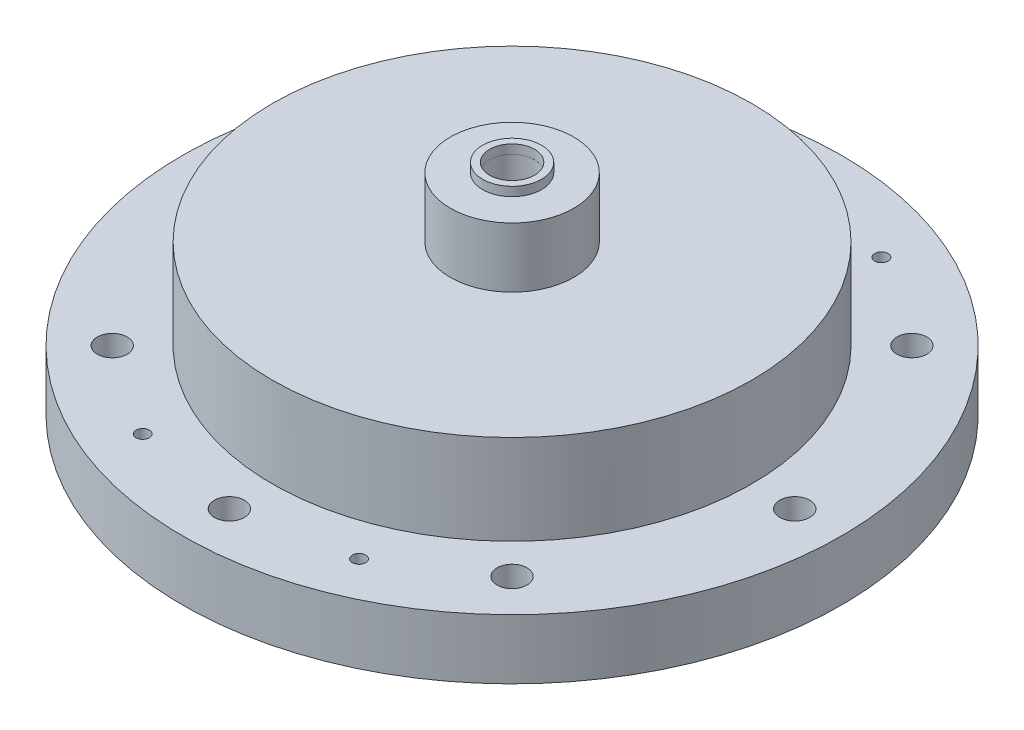
ISO-10303-21;
HEADER;
FILE_DESCRIPTION(('STEP AP214'),'2;1');
FILE_NAME('part.step','',(''),(''),'','','');
FILE_SCHEMA(('AUTOMOTIVE_DESIGN { 1 0 10303 214 1 1 1 1 }'));
ENDSEC;
DATA;
#1=APPLICATION_CONTEXT('core data for automotive mechanical design processes');
#2=APPLICATION_PROTOCOL_DEFINITION('international standard','automotive_design',2000,#1);
#3=PRODUCT_CONTEXT('',#1,'mechanical');
#4=PRODUCT('Part','Part','',(#3));
#5=PRODUCT_RELATED_PRODUCT_CATEGORY('part','',(#4));
#6=PRODUCT_DEFINITION_FORMATION('','',#4);
#7=PRODUCT_DEFINITION_CONTEXT('part definition',#1,'design');
#8=PRODUCT_DEFINITION('design','',#6,#7);
#9=PRODUCT_DEFINITION_SHAPE('','',#8);
#10=(LENGTH_UNIT() NAMED_UNIT(*) SI_UNIT(.MILLI.,.METRE.));
#11=(NAMED_UNIT(*) PLANE_ANGLE_UNIT() SI_UNIT($,.RADIAN.));
#12=(NAMED_UNIT(*) SI_UNIT($,.STERADIAN.) SOLID_ANGLE_UNIT());
#13=UNCERTAINTY_MEASURE_WITH_UNIT(LENGTH_MEASURE(1.E-05),#10,'distance_accuracy_value','');
#14=(GEOMETRIC_REPRESENTATION_CONTEXT(3) GLOBAL_UNCERTAINTY_ASSIGNED_CONTEXT((#13)) GLOBAL_UNIT_ASSIGNED_CONTEXT((#10,
#11,#12)) REPRESENTATION_CONTEXT('',''));
#15=CARTESIAN_POINT('',(0.,0.,0.));
#16=DIRECTION('',(0.,0.,1.));
#17=DIRECTION('',(1.,0.,0.));
#18=AXIS2_PLACEMENT_3D('',#15,#16,#17);
#19=CARTESIAN_POINT('',(0.,46.355,0.));
#20=DIRECTION('',(0.,-1.,0.));
#21=DIRECTION('',(0.,0.,-1.));
#22=AXIS2_PLACEMENT_3D('',#19,#20,#21);
#23=CYLINDRICAL_SURFACE('',#22,6.2484);
#24=CARTESIAN_POINT('',(0.,46.355,0.));
#25=DIRECTION('',(0.,1.,0.));
#26=DIRECTION('',(0.,0.,1.));
#27=AXIS2_PLACEMENT_3D('',#24,#25,#26);
#28=CIRCLE('',#27,6.2484);
#29=CARTESIAN_POINT('',(0.,46.355,6.2484));
#30=VERTEX_POINT('',#29);
#31=EDGE_CURVE('E11',#30,#30,#28,.T.);
#32=ORIENTED_EDGE('',*,*,#31,.F.);
#33=EDGE_LOOP('',(#32));
#34=FACE_BOUND('',#33,.T.);
#35=CARTESIAN_POINT('',(0.,44.45,0.));
#36=DIRECTION('',(0.,1.,0.));
#37=DIRECTION('',(0.,0.,1.));
#38=AXIS2_PLACEMENT_3D('',#35,#36,#37);
#39=CIRCLE('',#38,6.2484);
#40=CARTESIAN_POINT('',(0.,44.45,6.2484));
#41=VERTEX_POINT('',#40);
#42=EDGE_CURVE('E50',#41,#41,#39,.T.);
#43=ORIENTED_EDGE('',*,*,#42,.T.);
#44=EDGE_LOOP('',(#43));
#45=FACE_BOUND('',#44,.T.);
#46=ADVANCED_FACE('F43',(#34,#45),#23,.T.);
#47=CARTESIAN_POINT('',(0.,46.355,0.));
#48=DIRECTION('',(0.,1.,0.));
#49=DIRECTION('',(0.,0.,1.));
#50=AXIS2_PLACEMENT_3D('',#47,#48,#49);
#51=PLANE('',#50);
#52=CARTESIAN_POINT('',(0.,46.355,0.));
#53=DIRECTION('',(0.,1.,0.));
#54=DIRECTION('',(0.,0.,1.));
#55=AXIS2_PLACEMENT_3D('',#52,#53,#54);
#56=CIRCLE('',#55,4.7625);
#57=CARTESIAN_POINT('',(0.,46.355,4.7625));
#58=VERTEX_POINT('',#57);
#59=EDGE_CURVE('E56',#58,#58,#56,.T.);
#60=ORIENTED_EDGE('',*,*,#59,.F.);
#61=EDGE_LOOP('',(#60));
#62=FACE_BOUND('',#61,.T.);
#63=ORIENTED_EDGE('',*,*,#31,.T.);
#64=EDGE_LOOP('',(#63));
#65=FACE_BOUND('',#64,.T.);
#66=ADVANCED_FACE('F72',(#62,#65),#51,.T.);
#67=CARTESIAN_POINT('',(0.,44.45,0.));
#68=DIRECTION('',(0.,1.,0.));
#69=DIRECTION('',(0.,0.,1.));
#70=AXIS2_PLACEMENT_3D('',#67,#68,#69);
#71=PLANE('',#70);
#72=CARTESIAN_POINT('',(0.,44.45,0.));
#73=DIRECTION('',(0.,1.,0.));
#74=DIRECTION('',(0.,0.,1.));
#75=AXIS2_PLACEMENT_3D('',#72,#73,#74);
#76=CIRCLE('',#75,4.7625);
#77=CARTESIAN_POINT('',(0.,44.45,4.7625));
#78=VERTEX_POINT('',#77);
#79=EDGE_CURVE('E46',#78,#78,#76,.T.);
#80=ORIENTED_EDGE('',*,*,#79,.T.);
#81=EDGE_LOOP('',(#80));
#82=FACE_BOUND('',#81,.T.);
#83=ORIENTED_EDGE('',*,*,#42,.F.);
#84=EDGE_LOOP('',(#83));
#85=FACE_BOUND('',#84,.T.);
#86=ADVANCED_FACE('F63',(#82,#85),#71,.F.);
#87=CARTESIAN_POINT('',(0.,-4.445,0.));
#88=DIRECTION('',(0.,1.,0.));
#89=DIRECTION('',(0.,0.,1.));
#90=AXIS2_PLACEMENT_3D('',#87,#88,#89);
#91=CYLINDRICAL_SURFACE('',#90,4.7625);
#92=ORIENTED_EDGE('',*,*,#59,.T.);
#93=EDGE_LOOP('',(#92));
#94=FACE_BOUND('',#93,.T.);
#95=ORIENTED_EDGE('',*,*,#79,.F.);
#96=EDGE_LOOP('',(#95));
#97=FACE_BOUND('',#96,.T.);
#98=ADVANCED_FACE('F66',(#94,#97),#91,.F.);
#99=CLOSED_SHELL('',(#46,#66,#86,#98));
#100=MANIFOLD_SOLID_BREP('B2',#99);
#101=CARTESIAN_POINT('',(0.,25.4,0.));
#102=DIRECTION('',(0.,-1.,0.));
#103=DIRECTION('',(0.,0.,-1.));
#104=AXIS2_PLACEMENT_3D('',#101,#102,#103);
#105=CYLINDRICAL_SURFACE('',#104,50.8);
#106=CARTESIAN_POINT('',(0.,12.7,0.));
#107=DIRECTION('',(0.,-1.,0.));
#108=DIRECTION('',(0.,0.,-1.));
#109=AXIS2_PLACEMENT_3D('',#106,#107,#108);
#110=CIRCLE('',#109,50.8);
#111=CARTESIAN_POINT('',(0.,12.7,-50.8));
#112=VERTEX_POINT('',#111);
#113=EDGE_CURVE('E42',#112,#112,#110,.T.);
#114=ORIENTED_EDGE('',*,*,#113,.F.);
#115=EDGE_LOOP('',(#114));
#116=FACE_BOUND('',#115,.T.);
#117=CARTESIAN_POINT('',(0.,31.75,0.));
#118=DIRECTION('',(0.,1.,0.));
#119=DIRECTION('',(0.,0.,1.));
#120=AXIS2_PLACEMENT_3D('',#117,#118,#119);
#121=CIRCLE('',#120,50.8);
#122=CARTESIAN_POINT('',(0.,31.75,50.8));
#123=VERTEX_POINT('',#122);
#124=EDGE_CURVE('E160',#123,#123,#121,.T.);
#125=ORIENTED_EDGE('',*,*,#124,.F.);
#126=EDGE_LOOP('',(#125));
#127=FACE_BOUND('',#126,.T.);
#128=ADVANCED_FACE('F105',(#116,#127),#105,.T.);
#129=CARTESIAN_POINT('',(0.,12.7,0.));
#130=DIRECTION('',(0.,-1.,0.));
#131=DIRECTION('',(0.,0.,-1.));
#132=AXIS2_PLACEMENT_3D('',#129,#130,#131);
#133=CYLINDRICAL_SURFACE('',#132,69.85);
#134=CARTESIAN_POINT('',(0.,12.7,0.));
#135=DIRECTION('',(0.,-1.,0.));
#136=DIRECTION('',(0.,0.,-1.));
#137=AXIS2_PLACEMENT_3D('',#134,#135,#136);
#138=CIRCLE('',#137,69.85);
#139=CARTESIAN_POINT('',(0.,12.7,-69.85));
#140=VERTEX_POINT('',#139);
#141=EDGE_CURVE('E112',#140,#140,#138,.T.);
#142=ORIENTED_EDGE('',*,*,#141,.T.);
#143=EDGE_LOOP('',(#142));
#144=FACE_BOUND('',#143,.T.);
#145=CARTESIAN_POINT('',(0.,0.,0.));
#146=DIRECTION('',(0.,-1.,0.));
#147=DIRECTION('',(0.,0.,-1.));
#148=AXIS2_PLACEMENT_3D('',#145,#146,#147);
#149=CIRCLE('',#148,69.85);
#150=CARTESIAN_POINT('',(0.,0.,-69.85));
#151=VERTEX_POINT('',#150);
#152=EDGE_CURVE('E117',#151,#151,#149,.T.);
#153=ORIENTED_EDGE('',*,*,#152,.F.);
#154=EDGE_LOOP('',(#153));
#155=FACE_BOUND('',#154,.T.);
#156=ADVANCED_FACE('F228',(#144,#155),#133,.T.);
#157=CARTESIAN_POINT('',(0.,12.7,0.));
#158=DIRECTION('',(0.,-1.,0.));
#159=DIRECTION('',(0.,0.,-1.));
#160=AXIS2_PLACEMENT_3D('',#157,#158,#159);
#161=PLANE('',#160);
#162=CARTESIAN_POINT('',(22.9298555105109,12.7,55.3575681567308));
#163=DIRECTION('',(0.,-1.,0.));
#164=DIRECTION('',(0.,0.,-1.));
#165=AXIS2_PLACEMENT_3D('',#162,#163,#164);
#166=CIRCLE('',#165,1.4097);
#167=CARTESIAN_POINT('',(22.9298555105109,12.7,53.9478681567308));
#168=VERTEX_POINT('',#167);
#169=EDGE_CURVE('E108',#168,#168,#166,.T.);
#170=ORIENTED_EDGE('',*,*,#169,.T.);
#171=EDGE_LOOP('',(#170));
#172=FACE_BOUND('',#171,.T.);
#173=CARTESIAN_POINT('',(-22.9298555105109,12.7,-55.3575681567308));
#174=DIRECTION('',(0.,-1.,0.));
#175=DIRECTION('',(0.,0.,-1.));
#176=AXIS2_PLACEMENT_3D('',#173,#174,#175);
#177=CIRCLE('',#176,1.4097);
#178=CARTESIAN_POINT('',(-22.9298555105109,12.7,-56.7672681567308));
#179=VERTEX_POINT('',#178);
#180=EDGE_CURVE('E127',#179,#179,#177,.T.);
#181=ORIENTED_EDGE('',*,*,#180,.T.);
#182=EDGE_LOOP('',(#181));
#183=FACE_BOUND('',#182,.T.);
#184=CARTESIAN_POINT('',(22.9298555105109,12.7,-55.3575681567308));
#185=DIRECTION('',(0.,-1.,0.));
#186=DIRECTION('',(0.,0.,-1.));
#187=AXIS2_PLACEMENT_3D('',#184,#185,#186);
#188=CIRCLE('',#187,1.4097);
#189=CARTESIAN_POINT('',(22.9298555105109,12.7,-56.7672681567308));
#190=VERTEX_POINT('',#189);
#191=EDGE_CURVE('E124',#190,#190,#188,.T.);
#192=ORIENTED_EDGE('',*,*,#191,.T.);
#193=EDGE_LOOP('',(#192));
#194=FACE_BOUND('',#193,.T.);
#195=CARTESIAN_POINT('',(-22.9298555105109,12.7,55.3575681567308));
#196=DIRECTION('',(0.,-1.,0.));
#197=DIRECTION('',(0.,0.,-1.));
#198=AXIS2_PLACEMENT_3D('',#195,#196,#197);
#199=CIRCLE('',#198,1.4097);
#200=CARTESIAN_POINT('',(-22.9298555105109,12.7,53.9478681567308));
#201=VERTEX_POINT('',#200);
#202=EDGE_CURVE('E121',#201,#201,#199,.T.);
#203=ORIENTED_EDGE('',*,*,#202,.T.);
#204=EDGE_LOOP('',(#203));
#205=FACE_BOUND('',#204,.T.);
#206=CARTESIAN_POINT('',(0.,12.7,-59.9186));
#207=DIRECTION('',(0.,-1.,0.));
#208=DIRECTION('',(0.,0.,-1.));
#209=AXIS2_PLACEMENT_3D('',#206,#207,#208);
#210=CIRCLE('',#209,3.175);
#211=CARTESIAN_POINT('',(0.,12.7,-63.0936));
#212=VERTEX_POINT('',#211);
#213=EDGE_CURVE('E178',#212,#212,#210,.F.);
#214=ORIENTED_EDGE('',*,*,#213,.F.);
#215=EDGE_LOOP('',(#214));
#216=FACE_BOUND('',#215,.T.);
#217=CARTESIAN_POINT('',(-42.3688483792043,12.7,-42.3688483792043));
#218=DIRECTION('',(0.,-1.,0.));
#219=DIRECTION('',(0.,0.,-1.));
#220=AXIS2_PLACEMENT_3D('',#217,#218,#219);
#221=CIRCLE('',#220,3.17500000000001);
#222=CARTESIAN_POINT('',(-42.3688483792043,12.7,-45.5438483792043));
#223=VERTEX_POINT('',#222);
#224=EDGE_CURVE('E179',#223,#223,#221,.F.);
#225=ORIENTED_EDGE('',*,*,#224,.F.);
#226=EDGE_LOOP('',(#225));
#227=FACE_BOUND('',#226,.T.);
#228=CARTESIAN_POINT('',(-59.9186,12.7,0.));
#229=DIRECTION('',(0.,-1.,0.));
#230=DIRECTION('',(0.,0.,-1.));
#231=AXIS2_PLACEMENT_3D('',#228,#229,#230);
#232=CIRCLE('',#231,3.17499999999999);
#233=CARTESIAN_POINT('',(-59.9186,12.7,-3.17499999999999));
#234=VERTEX_POINT('',#233);
#235=EDGE_CURVE('E185',#234,#234,#232,.F.);
#236=ORIENTED_EDGE('',*,*,#235,.F.);
#237=EDGE_LOOP('',(#236));
#238=FACE_BOUND('',#237,.T.);
#239=CARTESIAN_POINT('',(-42.3688483792043,12.7,42.3688483792043));
#240=DIRECTION('',(0.,-1.,0.));
#241=DIRECTION('',(0.,0.,-1.));
#242=AXIS2_PLACEMENT_3D('',#239,#240,#241);
#243=CIRCLE('',#242,3.17499999999999);
#244=CARTESIAN_POINT('',(-42.3688483792043,12.7,39.1938483792043));
#245=VERTEX_POINT('',#244);
#246=EDGE_CURVE('E191',#245,#245,#243,.F.);
#247=ORIENTED_EDGE('',*,*,#246,.F.);
#248=EDGE_LOOP('',(#247));
#249=FACE_BOUND('',#248,.T.);
#250=CARTESIAN_POINT('',(0.,12.7,59.9186));
#251=DIRECTION('',(0.,-1.,0.));
#252=DIRECTION('',(0.,0.,-1.));
#253=AXIS2_PLACEMENT_3D('',#250,#251,#252);
#254=CIRCLE('',#253,3.17499999999999);
#255=CARTESIAN_POINT('',(0.,12.7,56.7436));
#256=VERTEX_POINT('',#255);
#257=EDGE_CURVE('E197',#256,#256,#254,.F.);
#258=ORIENTED_EDGE('',*,*,#257,.F.);
#259=EDGE_LOOP('',(#258));
#260=FACE_BOUND('',#259,.T.);
#261=CARTESIAN_POINT('',(42.3688483792043,12.7,42.3688483792043));
#262=DIRECTION('',(0.,-1.,0.));
#263=DIRECTION('',(0.,0.,-1.));
#264=AXIS2_PLACEMENT_3D('',#261,#262,#263);
#265=CIRCLE('',#264,3.17500000000001);
#266=CARTESIAN_POINT('',(42.3688483792043,12.7,39.1938483792043));
#267=VERTEX_POINT('',#266);
#268=EDGE_CURVE('E203',#267,#267,#265,.F.);
#269=ORIENTED_EDGE('',*,*,#268,.F.);
#270=EDGE_LOOP('',(#269));
#271=FACE_BOUND('',#270,.T.);
#272=CARTESIAN_POINT('',(59.9186,12.7,0.));
#273=DIRECTION('',(0.,-1.,0.));
#274=DIRECTION('',(0.,0.,-1.));
#275=AXIS2_PLACEMENT_3D('',#272,#273,#274);
#276=CIRCLE('',#275,3.175);
#277=CARTESIAN_POINT('',(59.9186,12.7,-3.17499999999999));
#278=VERTEX_POINT('',#277);
#279=EDGE_CURVE('E209',#278,#278,#276,.F.);
#280=ORIENTED_EDGE('',*,*,#279,.F.);
#281=EDGE_LOOP('',(#280));
#282=FACE_BOUND('',#281,.T.);
#283=CARTESIAN_POINT('',(42.3688483792043,12.7,-42.3688483792043));
#284=DIRECTION('',(0.,-1.,0.));
#285=DIRECTION('',(0.,0.,-1.));
#286=AXIS2_PLACEMENT_3D('',#283,#284,#285);
#287=CIRCLE('',#286,3.175);
#288=CARTESIAN_POINT('',(42.3688483792043,12.7,-45.5438483792042));
#289=VERTEX_POINT('',#288);
#290=EDGE_CURVE('E215',#289,#289,#287,.F.);
#291=ORIENTED_EDGE('',*,*,#290,.F.);
#292=EDGE_LOOP('',(#291));
#293=FACE_BOUND('',#292,.T.);
#294=ORIENTED_EDGE('',*,*,#113,.T.);
#295=EDGE_LOOP('',(#294));
#296=FACE_BOUND('',#295,.T.);
#297=ORIENTED_EDGE('',*,*,#141,.F.);
#298=EDGE_LOOP('',(#297));
#299=FACE_BOUND('',#298,.T.);
#300=ADVANCED_FACE('F225',(#172,#183,#194,#205,#216,#227,#238,#249,#260,#271,#282,#293,#296,
#299),#161,.F.);
#301=CARTESIAN_POINT('',(0.,0.,0.));
#302=DIRECTION('',(0.,1.,0.));
#303=DIRECTION('',(0.,0.,1.));
#304=AXIS2_PLACEMENT_3D('',#301,#302,#303);
#305=PLANE('',#304);
#306=CARTESIAN_POINT('',(22.9298555105109,0.,55.3575681567308));
#307=DIRECTION('',(0.,-1.,0.));
#308=DIRECTION('',(0.,0.,-1.));
#309=AXIS2_PLACEMENT_3D('',#306,#307,#308);
#310=CIRCLE('',#309,3.175);
#311=CARTESIAN_POINT('',(22.9298555105109,0.,52.1825681567308));
#312=VERTEX_POINT('',#311);
#313=EDGE_CURVE('E149',#312,#312,#310,.T.);
#314=ORIENTED_EDGE('',*,*,#313,.F.);
#315=EDGE_LOOP('',(#314));
#316=FACE_BOUND('',#315,.T.);
#317=CARTESIAN_POINT('',(-22.9298555105109,0.,-55.3575681567308));
#318=DIRECTION('',(0.,-1.,0.));
#319=DIRECTION('',(0.,0.,-1.));
#320=AXIS2_PLACEMENT_3D('',#317,#318,#319);
#321=CIRCLE('',#320,3.175);
#322=CARTESIAN_POINT('',(-22.9298555105109,0.,-58.5325681567308));
#323=VERTEX_POINT('',#322);
#324=EDGE_CURVE('E141',#323,#323,#321,.T.);
#325=ORIENTED_EDGE('',*,*,#324,.F.);
#326=EDGE_LOOP('',(#325));
#327=FACE_BOUND('',#326,.T.);
#328=CARTESIAN_POINT('',(22.9298555105109,0.,-55.3575681567308));
#329=DIRECTION('',(0.,-1.,0.));
#330=DIRECTION('',(0.,0.,-1.));
#331=AXIS2_PLACEMENT_3D('',#328,#329,#330);
#332=CIRCLE('',#331,3.175);
#333=CARTESIAN_POINT('',(22.9298555105109,0.,-58.5325681567308));
#334=VERTEX_POINT('',#333);
#335=EDGE_CURVE('E132',#334,#334,#332,.T.);
#336=ORIENTED_EDGE('',*,*,#335,.F.);
#337=EDGE_LOOP('',(#336));
#338=FACE_BOUND('',#337,.T.);
#339=CARTESIAN_POINT('',(-22.9298555105109,0.,55.3575681567308));
#340=DIRECTION('',(0.,-1.,0.));
#341=DIRECTION('',(0.,0.,-1.));
#342=AXIS2_PLACEMENT_3D('',#339,#340,#341);
#343=CIRCLE('',#342,3.175);
#344=CARTESIAN_POINT('',(-22.9298555105109,0.,52.1825681567308));
#345=VERTEX_POINT('',#344);
#346=EDGE_CURVE('E148',#345,#345,#343,.T.);
#347=ORIENTED_EDGE('',*,*,#346,.F.);
#348=EDGE_LOOP('',(#347));
#349=FACE_BOUND('',#348,.T.);
#350=CARTESIAN_POINT('',(0.,0.,-59.9186));
#351=DIRECTION('',(0.,-1.,0.));
#352=DIRECTION('',(0.,0.,-1.));
#353=AXIS2_PLACEMENT_3D('',#350,#351,#352);
#354=CIRCLE('',#353,3.175);
#355=CARTESIAN_POINT('',(0.,0.,-63.0936));
#356=VERTEX_POINT('',#355);
#357=EDGE_CURVE('E175',#356,#356,#354,.T.);
#358=ORIENTED_EDGE('',*,*,#357,.F.);
#359=EDGE_LOOP('',(#358));
#360=FACE_BOUND('',#359,.T.);
#361=CARTESIAN_POINT('',(-42.3688483792043,0.,-42.3688483792043));
#362=DIRECTION('',(0.,-1.,0.));
#363=DIRECTION('',(0.,0.,-1.));
#364=AXIS2_PLACEMENT_3D('',#361,#362,#363);
#365=CIRCLE('',#364,3.17500000000001);
#366=CARTESIAN_POINT('',(-42.3688483792043,0.,-45.5438483792043));
#367=VERTEX_POINT('',#366);
#368=EDGE_CURVE('E182',#367,#367,#365,.T.);
#369=ORIENTED_EDGE('',*,*,#368,.F.);
#370=EDGE_LOOP('',(#369));
#371=FACE_BOUND('',#370,.T.);
#372=CARTESIAN_POINT('',(-59.9186,0.,0.));
#373=DIRECTION('',(0.,-1.,0.));
#374=DIRECTION('',(0.,0.,-1.));
#375=AXIS2_PLACEMENT_3D('',#372,#373,#374);
#376=CIRCLE('',#375,3.17499999999999);
#377=CARTESIAN_POINT('',(-59.9186,0.,-3.17499999999999));
#378=VERTEX_POINT('',#377);
#379=EDGE_CURVE('E188',#378,#378,#376,.T.);
#380=ORIENTED_EDGE('',*,*,#379,.F.);
#381=EDGE_LOOP('',(#380));
#382=FACE_BOUND('',#381,.T.);
#383=CARTESIAN_POINT('',(-42.3688483792043,0.,42.3688483792043));
#384=DIRECTION('',(0.,-1.,0.));
#385=DIRECTION('',(0.,0.,-1.));
#386=AXIS2_PLACEMENT_3D('',#383,#384,#385);
#387=CIRCLE('',#386,3.17499999999999);
#388=CARTESIAN_POINT('',(-42.3688483792043,0.,39.1938483792043));
#389=VERTEX_POINT('',#388);
#390=EDGE_CURVE('E194',#389,#389,#387,.T.);
#391=ORIENTED_EDGE('',*,*,#390,.F.);
#392=EDGE_LOOP('',(#391));
#393=FACE_BOUND('',#392,.T.);
#394=CARTESIAN_POINT('',(0.,0.,59.9186));
#395=DIRECTION('',(0.,-1.,0.));
#396=DIRECTION('',(0.,0.,-1.));
#397=AXIS2_PLACEMENT_3D('',#394,#395,#396);
#398=CIRCLE('',#397,3.17499999999999);
#399=CARTESIAN_POINT('',(0.,0.,56.7436));
#400=VERTEX_POINT('',#399);
#401=EDGE_CURVE('E200',#400,#400,#398,.T.);
#402=ORIENTED_EDGE('',*,*,#401,.F.);
#403=EDGE_LOOP('',(#402));
#404=FACE_BOUND('',#403,.T.);
#405=CARTESIAN_POINT('',(42.3688483792043,0.,42.3688483792043));
#406=DIRECTION('',(0.,-1.,0.));
#407=DIRECTION('',(0.,0.,-1.));
#408=AXIS2_PLACEMENT_3D('',#405,#406,#407);
#409=CIRCLE('',#408,3.17500000000001);
#410=CARTESIAN_POINT('',(42.3688483792043,0.,39.1938483792043));
#411=VERTEX_POINT('',#410);
#412=EDGE_CURVE('E206',#411,#411,#409,.T.);
#413=ORIENTED_EDGE('',*,*,#412,.F.);
#414=EDGE_LOOP('',(#413));
#415=FACE_BOUND('',#414,.T.);
#416=CARTESIAN_POINT('',(59.9186,0.,0.));
#417=DIRECTION('',(0.,-1.,0.));
#418=DIRECTION('',(0.,0.,-1.));
#419=AXIS2_PLACEMENT_3D('',#416,#417,#418);
#420=CIRCLE('',#419,3.175);
#421=CARTESIAN_POINT('',(59.9186,0.,-3.17499999999999));
#422=VERTEX_POINT('',#421);
#423=EDGE_CURVE('E212',#422,#422,#420,.T.);
#424=ORIENTED_EDGE('',*,*,#423,.F.);
#425=EDGE_LOOP('',(#424));
#426=FACE_BOUND('',#425,.T.);
#427=CARTESIAN_POINT('',(42.3688483792043,0.,-42.3688483792043));
#428=DIRECTION('',(0.,-1.,0.));
#429=DIRECTION('',(0.,0.,-1.));
#430=AXIS2_PLACEMENT_3D('',#427,#428,#429);
#431=CIRCLE('',#430,3.175);
#432=CARTESIAN_POINT('',(42.3688483792043,0.,-45.5438483792042));
#433=VERTEX_POINT('',#432);
#434=EDGE_CURVE('E174',#433,#433,#431,.T.);
#435=ORIENTED_EDGE('',*,*,#434,.F.);
#436=EDGE_LOOP('',(#435));
#437=FACE_BOUND('',#436,.T.);
#438=ORIENTED_EDGE('',*,*,#152,.T.);
#439=EDGE_LOOP('',(#438));
#440=FACE_BOUND('',#439,.T.);
#441=CARTESIAN_POINT('',(0.,0.,0.));
#442=DIRECTION('',(0.,-1.,0.));
#443=DIRECTION('',(0.,0.,-1.));
#444=AXIS2_PLACEMENT_3D('',#441,#442,#443);
#445=CIRCLE('',#444,4.7625);
#446=CARTESIAN_POINT('',(0.,0.,-4.7625));
#447=VERTEX_POINT('',#446);
#448=EDGE_CURVE('E244',#447,#447,#445,.T.);
#449=ORIENTED_EDGE('',*,*,#448,.F.);
#450=EDGE_LOOP('',(#449));
#451=FACE_BOUND('',#450,.T.);
#452=ADVANCED_FACE('F227',(#316,#327,#338,#349,#360,#371,#382,#393,#404,#415,#426,#437,#440,
#451),#305,.F.);
#453=CARTESIAN_POINT('',(42.3688483792043,25.401,-42.3688483792043));
#454=DIRECTION('',(0.,-1.,0.));
#455=DIRECTION('',(0.,0.,-1.));
#456=AXIS2_PLACEMENT_3D('',#453,#454,#455);
#457=CYLINDRICAL_SURFACE('',#456,3.175);
#458=ORIENTED_EDGE('',*,*,#434,.T.);
#459=EDGE_LOOP('',(#458));
#460=FACE_BOUND('',#459,.T.);
#461=ORIENTED_EDGE('',*,*,#290,.T.);
#462=EDGE_LOOP('',(#461));
#463=FACE_BOUND('',#462,.T.);
#464=ADVANCED_FACE('F223',(#460,#463),#457,.F.);
#465=CARTESIAN_POINT('',(59.9186,25.401,0.));
#466=DIRECTION('',(0.,-1.,0.));
#467=DIRECTION('',(0.,0.,-1.));
#468=AXIS2_PLACEMENT_3D('',#465,#466,#467);
#469=CYLINDRICAL_SURFACE('',#468,3.175);
#470=ORIENTED_EDGE('',*,*,#423,.T.);
#471=EDGE_LOOP('',(#470));
#472=FACE_BOUND('',#471,.T.);
#473=ORIENTED_EDGE('',*,*,#279,.T.);
#474=EDGE_LOOP('',(#473));
#475=FACE_BOUND('',#474,.T.);
#476=ADVANCED_FACE('F294',(#472,#475),#469,.F.);
#477=CARTESIAN_POINT('',(42.3688483792043,25.401,42.3688483792043));
#478=DIRECTION('',(0.,-1.,0.));
#479=DIRECTION('',(0.,0.,-1.));
#480=AXIS2_PLACEMENT_3D('',#477,#478,#479);
#481=CYLINDRICAL_SURFACE('',#480,3.17500000000001);
#482=ORIENTED_EDGE('',*,*,#412,.T.);
#483=EDGE_LOOP('',(#482));
#484=FACE_BOUND('',#483,.T.);
#485=ORIENTED_EDGE('',*,*,#268,.T.);
#486=EDGE_LOOP('',(#485));
#487=FACE_BOUND('',#486,.T.);
#488=ADVANCED_FACE('F299',(#484,#487),#481,.F.);
#489=CARTESIAN_POINT('',(0.,25.401,59.9186));
#490=DIRECTION('',(0.,-1.,0.));
#491=DIRECTION('',(0.,0.,-1.));
#492=AXIS2_PLACEMENT_3D('',#489,#490,#491);
#493=CYLINDRICAL_SURFACE('',#492,3.17499999999999);
#494=ORIENTED_EDGE('',*,*,#401,.T.);
#495=EDGE_LOOP('',(#494));
#496=FACE_BOUND('',#495,.T.);
#497=ORIENTED_EDGE('',*,*,#257,.T.);
#498=EDGE_LOOP('',(#497));
#499=FACE_BOUND('',#498,.T.);
#500=ADVANCED_FACE('F343',(#496,#499),#493,.F.);
#501=CARTESIAN_POINT('',(-42.3688483792043,25.401,42.3688483792043));
#502=DIRECTION('',(0.,-1.,0.));
#503=DIRECTION('',(0.,0.,-1.));
#504=AXIS2_PLACEMENT_3D('',#501,#502,#503);
#505=CYLINDRICAL_SURFACE('',#504,3.17499999999999);
#506=ORIENTED_EDGE('',*,*,#390,.T.);
#507=EDGE_LOOP('',(#506));
#508=FACE_BOUND('',#507,.T.);
#509=ORIENTED_EDGE('',*,*,#246,.T.);
#510=EDGE_LOOP('',(#509));
#511=FACE_BOUND('',#510,.T.);
#512=ADVANCED_FACE('F339',(#508,#511),#505,.F.);
#513=CARTESIAN_POINT('',(-59.9186,25.401,0.));
#514=DIRECTION('',(0.,-1.,0.));
#515=DIRECTION('',(0.,0.,-1.));
#516=AXIS2_PLACEMENT_3D('',#513,#514,#515);
#517=CYLINDRICAL_SURFACE('',#516,3.17499999999999);
#518=ORIENTED_EDGE('',*,*,#379,.T.);
#519=EDGE_LOOP('',(#518));
#520=FACE_BOUND('',#519,.T.);
#521=ORIENTED_EDGE('',*,*,#235,.T.);
#522=EDGE_LOOP('',(#521));
#523=FACE_BOUND('',#522,.T.);
#524=ADVANCED_FACE('F335',(#520,#523),#517,.F.);
#525=CARTESIAN_POINT('',(-42.3688483792043,25.401,-42.3688483792043));
#526=DIRECTION('',(0.,-1.,0.));
#527=DIRECTION('',(0.,0.,-1.));
#528=AXIS2_PLACEMENT_3D('',#525,#526,#527);
#529=CYLINDRICAL_SURFACE('',#528,3.17500000000001);
#530=ORIENTED_EDGE('',*,*,#368,.T.);
#531=EDGE_LOOP('',(#530));
#532=FACE_BOUND('',#531,.T.);
#533=ORIENTED_EDGE('',*,*,#224,.T.);
#534=EDGE_LOOP('',(#533));
#535=FACE_BOUND('',#534,.T.);
#536=ADVANCED_FACE('F322',(#532,#535),#529,.F.);
#537=CARTESIAN_POINT('',(0.,25.401,-59.9186));
#538=DIRECTION('',(0.,-1.,0.));
#539=DIRECTION('',(0.,0.,-1.));
#540=AXIS2_PLACEMENT_3D('',#537,#538,#539);
#541=CYLINDRICAL_SURFACE('',#540,3.175);
#542=ORIENTED_EDGE('',*,*,#357,.T.);
#543=EDGE_LOOP('',(#542));
#544=FACE_BOUND('',#543,.T.);
#545=ORIENTED_EDGE('',*,*,#213,.T.);
#546=EDGE_LOOP('',(#545));
#547=FACE_BOUND('',#546,.T.);
#548=ADVANCED_FACE('F312',(#544,#547),#541,.F.);
#549=CARTESIAN_POINT('',(0.,31.75,0.));
#550=DIRECTION('',(0.,1.,0.));
#551=DIRECTION('',(0.,0.,1.));
#552=AXIS2_PLACEMENT_3D('',#549,#550,#551);
#553=PLANE('',#552);
#554=CARTESIAN_POINT('',(0.,31.75,0.));
#555=DIRECTION('',(0.,1.,0.));
#556=DIRECTION('',(0.,0.,1.));
#557=AXIS2_PLACEMENT_3D('',#554,#555,#556);
#558=CIRCLE('',#557,13.081);
#559=CARTESIAN_POINT('',(0.,31.75,13.081));
#560=VERTEX_POINT('',#559);
#561=EDGE_CURVE('E165',#560,#560,#558,.T.);
#562=ORIENTED_EDGE('',*,*,#561,.F.);
#563=EDGE_LOOP('',(#562));
#564=FACE_BOUND('',#563,.T.);
#565=ORIENTED_EDGE('',*,*,#124,.T.);
#566=EDGE_LOOP('',(#565));
#567=FACE_BOUND('',#566,.T.);
#568=ADVANCED_FACE('F309',(#564,#567),#553,.T.);
#569=CARTESIAN_POINT('',(0.,44.45,0.));
#570=DIRECTION('',(0.,-1.,0.));
#571=DIRECTION('',(0.,0.,-1.));
#572=AXIS2_PLACEMENT_3D('',#569,#570,#571);
#573=CYLINDRICAL_SURFACE('',#572,13.081);
#574=ORIENTED_EDGE('',*,*,#561,.T.);
#575=EDGE_LOOP('',(#574));
#576=FACE_BOUND('',#575,.T.);
#577=CARTESIAN_POINT('',(0.,44.45,0.));
#578=DIRECTION('',(0.,1.,0.));
#579=DIRECTION('',(0.,0.,1.));
#580=AXIS2_PLACEMENT_3D('',#577,#578,#579);
#581=CIRCLE('',#580,13.081);
#582=CARTESIAN_POINT('',(0.,44.45,13.081));
#583=VERTEX_POINT('',#582);
#584=EDGE_CURVE('E171',#583,#583,#581,.T.);
#585=ORIENTED_EDGE('',*,*,#584,.F.);
#586=EDGE_LOOP('',(#585));
#587=FACE_BOUND('',#586,.T.);
#588=ADVANCED_FACE('F311',(#576,#587),#573,.T.);
#589=CARTESIAN_POINT('',(0.,44.45,0.));
#590=DIRECTION('',(0.,1.,0.));
#591=DIRECTION('',(0.,0.,1.));
#592=AXIS2_PLACEMENT_3D('',#589,#590,#591);
#593=PLANE('',#592);
#594=ORIENTED_EDGE('',*,*,#584,.T.);
#595=EDGE_LOOP('',(#594));
#596=FACE_BOUND('',#595,.T.);
#597=CARTESIAN_POINT('',(0.,44.45,0.));
#598=DIRECTION('',(0.,1.,0.));
#599=DIRECTION('',(0.,0.,1.));
#600=AXIS2_PLACEMENT_3D('',#597,#598,#599);
#601=CIRCLE('',#600,4.7625);
#602=CARTESIAN_POINT('',(0.,44.45,4.7625));
#603=VERTEX_POINT('',#602);
#604=EDGE_CURVE('E168',#603,#603,#601,.T.);
#605=ORIENTED_EDGE('',*,*,#604,.F.);
#606=EDGE_LOOP('',(#605));
#607=FACE_BOUND('',#606,.T.);
#608=ADVANCED_FACE('F319',(#596,#607),#593,.T.);
#609=CARTESIAN_POINT('',(0.,44.45,0.));
#610=DIRECTION('',(0.,-1.,0.));
#611=DIRECTION('',(0.,0.,-1.));
#612=AXIS2_PLACEMENT_3D('',#609,#610,#611);
#613=CYLINDRICAL_SURFACE('',#612,4.7625);
#614=ORIENTED_EDGE('',*,*,#604,.T.);
#615=EDGE_LOOP('',(#614));
#616=FACE_BOUND('',#615,.T.);
#617=ORIENTED_EDGE('',*,*,#448,.T.);
#618=EDGE_LOOP('',(#617));
#619=FACE_BOUND('',#618,.T.);
#620=ADVANCED_FACE('F272',(#616,#619),#613,.F.);
#621=CARTESIAN_POINT('',(-22.9298555105109,6.35,55.3575681567308));
#622=DIRECTION('',(0.,-1.,0.));
#623=DIRECTION('',(0.,0.,-1.));
#624=AXIS2_PLACEMENT_3D('',#621,#622,#623);
#625=CYLINDRICAL_SURFACE('',#624,3.175);
#626=CARTESIAN_POINT('',(-22.9298555105109,6.35,55.3575681567308));
#627=DIRECTION('',(0.,-1.,0.));
#628=DIRECTION('',(0.,0.,-1.));
#629=AXIS2_PLACEMENT_3D('',#626,#627,#628);
#630=CIRCLE('',#629,3.175);
#631=CARTESIAN_POINT('',(-22.9298555105109,6.35,52.1825681567308));
#632=VERTEX_POINT('',#631);
#633=EDGE_CURVE('E157',#632,#632,#630,.T.);
#634=ORIENTED_EDGE('',*,*,#633,.F.);
#635=EDGE_LOOP('',(#634));
#636=FACE_BOUND('',#635,.T.);
#637=ORIENTED_EDGE('',*,*,#346,.T.);
#638=EDGE_LOOP('',(#637));
#639=FACE_BOUND('',#638,.T.);
#640=ADVANCED_FACE('F266',(#636,#639),#625,.F.);
#641=CARTESIAN_POINT('',(-22.9298555105109,6.35,55.3575681567308));
#642=DIRECTION('',(0.,-1.,0.));
#643=DIRECTION('',(0.,0.,-1.));
#644=AXIS2_PLACEMENT_3D('',#641,#642,#643);
#645=PLANE('',#644);
#646=CARTESIAN_POINT('',(-22.9298555105109,6.35,55.3575681567308));
#647=DIRECTION('',(0.,-1.,0.));
#648=DIRECTION('',(0.,0.,-1.));
#649=AXIS2_PLACEMENT_3D('',#646,#647,#648);
#650=CIRCLE('',#649,1.4097);
#651=CARTESIAN_POINT('',(-22.9298555105109,6.35,53.9478681567308));
#652=VERTEX_POINT('',#651);
#653=EDGE_CURVE('E125',#652,#652,#650,.T.);
#654=ORIENTED_EDGE('',*,*,#653,.F.);
#655=EDGE_LOOP('',(#654));
#656=FACE_BOUND('',#655,.T.);
#657=ORIENTED_EDGE('',*,*,#633,.T.);
#658=EDGE_LOOP('',(#657));
#659=FACE_BOUND('',#658,.T.);
#660=ADVANCED_FACE('F262',(#656,#659),#645,.T.);
#661=CARTESIAN_POINT('',(22.9298555105109,6.35,-55.3575681567308));
#662=DIRECTION('',(0.,-1.,0.));
#663=DIRECTION('',(0.,0.,-1.));
#664=AXIS2_PLACEMENT_3D('',#661,#662,#663);
#665=CYLINDRICAL_SURFACE('',#664,3.175);
#666=CARTESIAN_POINT('',(22.9298555105109,6.35,-55.3575681567308));
#667=DIRECTION('',(0.,-1.,0.));
#668=DIRECTION('',(0.,0.,-1.));
#669=AXIS2_PLACEMENT_3D('',#666,#667,#668);
#670=CIRCLE('',#669,3.175);
#671=CARTESIAN_POINT('',(22.9298555105109,6.35,-58.5325681567308));
#672=VERTEX_POINT('',#671);
#673=EDGE_CURVE('E136',#672,#672,#670,.T.);
#674=ORIENTED_EDGE('',*,*,#673,.F.);
#675=EDGE_LOOP('',(#674));
#676=FACE_BOUND('',#675,.T.);
#677=ORIENTED_EDGE('',*,*,#335,.T.);
#678=EDGE_LOOP('',(#677));
#679=FACE_BOUND('',#678,.T.);
#680=ADVANCED_FACE('F265',(#676,#679),#665,.F.);
#681=CARTESIAN_POINT('',(22.9298555105109,6.35,-55.3575681567308));
#682=DIRECTION('',(0.,-1.,0.));
#683=DIRECTION('',(0.,0.,-1.));
#684=AXIS2_PLACEMENT_3D('',#681,#682,#683);
#685=PLANE('',#684);
#686=CARTESIAN_POINT('',(22.9298555105109,6.35,-55.3575681567308));
#687=DIRECTION('',(0.,-1.,0.));
#688=DIRECTION('',(0.,0.,-1.));
#689=AXIS2_PLACEMENT_3D('',#686,#687,#688);
#690=CIRCLE('',#689,1.4097);
#691=CARTESIAN_POINT('',(22.9298555105109,6.35,-56.7672681567308));
#692=VERTEX_POINT('',#691);
#693=EDGE_CURVE('E246',#692,#692,#690,.T.);
#694=ORIENTED_EDGE('',*,*,#693,.F.);
#695=EDGE_LOOP('',(#694));
#696=FACE_BOUND('',#695,.T.);
#697=ORIENTED_EDGE('',*,*,#673,.T.);
#698=EDGE_LOOP('',(#697));
#699=FACE_BOUND('',#698,.T.);
#700=ADVANCED_FACE('F421',(#696,#699),#685,.T.);
#701=CARTESIAN_POINT('',(-22.9298555105109,6.35,-55.3575681567308));
#702=DIRECTION('',(0.,-1.,0.));
#703=DIRECTION('',(0.,0.,-1.));
#704=AXIS2_PLACEMENT_3D('',#701,#702,#703);
#705=CYLINDRICAL_SURFACE('',#704,3.175);
#706=CARTESIAN_POINT('',(-22.9298555105109,6.35,-55.3575681567308));
#707=DIRECTION('',(0.,-1.,0.));
#708=DIRECTION('',(0.,0.,-1.));
#709=AXIS2_PLACEMENT_3D('',#706,#707,#708);
#710=CIRCLE('',#709,3.175);
#711=CARTESIAN_POINT('',(-22.9298555105109,6.35,-58.5325681567308));
#712=VERTEX_POINT('',#711);
#713=EDGE_CURVE('E152',#712,#712,#710,.T.);
#714=ORIENTED_EDGE('',*,*,#713,.F.);
#715=EDGE_LOOP('',(#714));
#716=FACE_BOUND('',#715,.T.);
#717=ORIENTED_EDGE('',*,*,#324,.T.);
#718=EDGE_LOOP('',(#717));
#719=FACE_BOUND('',#718,.T.);
#720=ADVANCED_FACE('F429',(#716,#719),#705,.F.);
#721=CARTESIAN_POINT('',(-22.9298555105109,6.35,-55.3575681567308));
#722=DIRECTION('',(0.,-1.,0.));
#723=DIRECTION('',(0.,0.,-1.));
#724=AXIS2_PLACEMENT_3D('',#721,#722,#723);
#725=PLANE('',#724);
#726=CARTESIAN_POINT('',(-22.9298555105109,6.35,-55.3575681567308));
#727=DIRECTION('',(0.,-1.,0.));
#728=DIRECTION('',(0.,0.,-1.));
#729=AXIS2_PLACEMENT_3D('',#726,#727,#728);
#730=CIRCLE('',#729,1.4097);
#731=CARTESIAN_POINT('',(-22.9298555105109,6.35,-56.7672681567308));
#732=VERTEX_POINT('',#731);
#733=EDGE_CURVE('E249',#732,#732,#730,.T.);
#734=ORIENTED_EDGE('',*,*,#733,.F.);
#735=EDGE_LOOP('',(#734));
#736=FACE_BOUND('',#735,.T.);
#737=ORIENTED_EDGE('',*,*,#713,.T.);
#738=EDGE_LOOP('',(#737));
#739=FACE_BOUND('',#738,.T.);
#740=ADVANCED_FACE('F434',(#736,#739),#725,.T.);
#741=CARTESIAN_POINT('',(22.9298555105109,6.35,55.3575681567308));
#742=DIRECTION('',(0.,-1.,0.));
#743=DIRECTION('',(0.,0.,-1.));
#744=AXIS2_PLACEMENT_3D('',#741,#742,#743);
#745=CYLINDRICAL_SURFACE('',#744,3.175);
#746=CARTESIAN_POINT('',(22.9298555105109,6.35,55.3575681567308));
#747=DIRECTION('',(0.,-1.,0.));
#748=DIRECTION('',(0.,0.,-1.));
#749=AXIS2_PLACEMENT_3D('',#746,#747,#748);
#750=CIRCLE('',#749,3.175);
#751=CARTESIAN_POINT('',(22.9298555105109,6.35,52.1825681567308));
#752=VERTEX_POINT('',#751);
#753=EDGE_CURVE('E145',#752,#752,#750,.T.);
#754=ORIENTED_EDGE('',*,*,#753,.F.);
#755=EDGE_LOOP('',(#754));
#756=FACE_BOUND('',#755,.T.);
#757=ORIENTED_EDGE('',*,*,#313,.T.);
#758=EDGE_LOOP('',(#757));
#759=FACE_BOUND('',#758,.T.);
#760=ADVANCED_FACE('F442',(#756,#759),#745,.F.);
#761=CARTESIAN_POINT('',(22.9298555105109,6.35,55.3575681567308));
#762=DIRECTION('',(0.,-1.,0.));
#763=DIRECTION('',(0.,0.,-1.));
#764=AXIS2_PLACEMENT_3D('',#761,#762,#763);
#765=PLANE('',#764);
#766=CARTESIAN_POINT('',(22.9298555105109,6.35,55.3575681567308));
#767=DIRECTION('',(0.,-1.,0.));
#768=DIRECTION('',(0.,0.,-1.));
#769=AXIS2_PLACEMENT_3D('',#766,#767,#768);
#770=CIRCLE('',#769,1.4097);
#771=CARTESIAN_POINT('',(22.9298555105109,6.35,53.9478681567308));
#772=VERTEX_POINT('',#771);
#773=EDGE_CURVE('E252',#772,#772,#770,.T.);
#774=ORIENTED_EDGE('',*,*,#773,.F.);
#775=EDGE_LOOP('',(#774));
#776=FACE_BOUND('',#775,.T.);
#777=ORIENTED_EDGE('',*,*,#753,.T.);
#778=EDGE_LOOP('',(#777));
#779=FACE_BOUND('',#778,.T.);
#780=ADVANCED_FACE('F447',(#776,#779),#765,.T.);
#781=CARTESIAN_POINT('',(-22.9298555105109,46.355,55.3575681567308));
#782=DIRECTION('',(0.,-1.,0.));
#783=DIRECTION('',(0.,0.,-1.));
#784=AXIS2_PLACEMENT_3D('',#781,#782,#783);
#785=CYLINDRICAL_SURFACE('',#784,1.4097);
#786=ORIENTED_EDGE('',*,*,#653,.T.);
#787=EDGE_LOOP('',(#786));
#788=FACE_BOUND('',#787,.T.);
#789=ORIENTED_EDGE('',*,*,#202,.F.);
#790=EDGE_LOOP('',(#789));
#791=FACE_BOUND('',#790,.T.);
#792=ADVANCED_FACE('F259',(#788,#791),#785,.F.);
#793=CARTESIAN_POINT('',(22.9298555105109,46.355,-55.3575681567308));
#794=DIRECTION('',(0.,-1.,0.));
#795=DIRECTION('',(0.,0.,-1.));
#796=AXIS2_PLACEMENT_3D('',#793,#794,#795);
#797=CYLINDRICAL_SURFACE('',#796,1.4097);
#798=ORIENTED_EDGE('',*,*,#693,.T.);
#799=EDGE_LOOP('',(#798));
#800=FACE_BOUND('',#799,.T.);
#801=ORIENTED_EDGE('',*,*,#191,.F.);
#802=EDGE_LOOP('',(#801));
#803=FACE_BOUND('',#802,.T.);
#804=ADVANCED_FACE('F493',(#800,#803),#797,.F.);
#805=CARTESIAN_POINT('',(-22.9298555105109,46.355,-55.3575681567308));
#806=DIRECTION('',(0.,-1.,0.));
#807=DIRECTION('',(0.,0.,-1.));
#808=AXIS2_PLACEMENT_3D('',#805,#806,#807);
#809=CYLINDRICAL_SURFACE('',#808,1.4097);
#810=ORIENTED_EDGE('',*,*,#733,.T.);
#811=EDGE_LOOP('',(#810));
#812=FACE_BOUND('',#811,.T.);
#813=ORIENTED_EDGE('',*,*,#180,.F.);
#814=EDGE_LOOP('',(#813));
#815=FACE_BOUND('',#814,.T.);
#816=ADVANCED_FACE('F502',(#812,#815),#809,.F.);
#817=CARTESIAN_POINT('',(22.9298555105109,46.355,55.3575681567308));
#818=DIRECTION('',(0.,-1.,0.));
#819=DIRECTION('',(0.,0.,-1.));
#820=AXIS2_PLACEMENT_3D('',#817,#818,#819);
#821=CYLINDRICAL_SURFACE('',#820,1.4097);
#822=ORIENTED_EDGE('',*,*,#773,.T.);
#823=EDGE_LOOP('',(#822));
#824=FACE_BOUND('',#823,.T.);
#825=ORIENTED_EDGE('',*,*,#169,.F.);
#826=EDGE_LOOP('',(#825));
#827=FACE_BOUND('',#826,.T.);
#828=ADVANCED_FACE('F512',(#824,#827),#821,.F.);
#829=CLOSED_SHELL('',(#128,#156,#300,#452,#464,#476,#488,#500,#512,#524,#536,#548,#568,#588,
#608,#620,#640,#660,#680,#700,#720,#740,#760,#780,#792,#804,#816,#828));
#830=MANIFOLD_SOLID_BREP('B6',#829);
#831=ADVANCED_BREP_SHAPE_REPRESENTATION('',(#18,#100,#830),#14);
#832=SHAPE_DEFINITION_REPRESENTATION(#9,#831);
ENDSEC;
END-ISO-10303-21;
